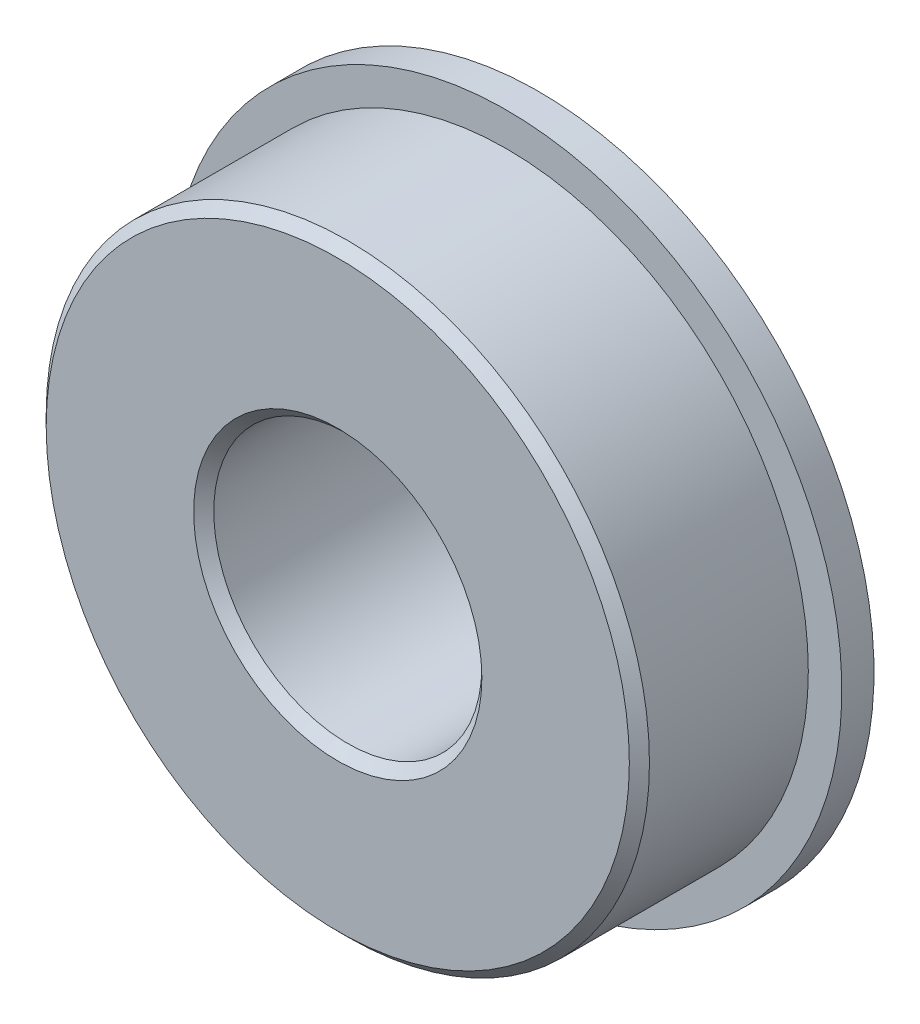
ISO-10303-21;
HEADER;
FILE_DESCRIPTION(('STEP AP214'),'2;1');
FILE_NAME('part.step','',(''),(''),'','','');
FILE_SCHEMA(('AUTOMOTIVE_DESIGN { 1 0 10303 214 1 1 1 1 }'));
ENDSEC;
DATA;
#1=APPLICATION_CONTEXT('core data for automotive mechanical design processes');
#2=APPLICATION_PROTOCOL_DEFINITION('international standard','automotive_design',2000,#1);
#3=PRODUCT_CONTEXT('',#1,'mechanical');
#4=PRODUCT('Part','Part','',(#3));
#5=PRODUCT_RELATED_PRODUCT_CATEGORY('part','',(#4));
#6=PRODUCT_DEFINITION_FORMATION('','',#4);
#7=PRODUCT_DEFINITION_CONTEXT('part definition',#1,'design');
#8=PRODUCT_DEFINITION('design','',#6,#7);
#9=PRODUCT_DEFINITION_SHAPE('','',#8);
#10=(LENGTH_UNIT() NAMED_UNIT(*) SI_UNIT(.MILLI.,.METRE.));
#11=(NAMED_UNIT(*) PLANE_ANGLE_UNIT() SI_UNIT($,.RADIAN.));
#12=(NAMED_UNIT(*) SI_UNIT($,.STERADIAN.) SOLID_ANGLE_UNIT());
#13=UNCERTAINTY_MEASURE_WITH_UNIT(LENGTH_MEASURE(1.E-05),#10,'distance_accuracy_value','');
#14=(GEOMETRIC_REPRESENTATION_CONTEXT(3) GLOBAL_UNCERTAINTY_ASSIGNED_CONTEXT((#13)) GLOBAL_UNIT_ASSIGNED_CONTEXT((#10,
#11,#12)) REPRESENTATION_CONTEXT('',''));
#15=CARTESIAN_POINT('',(0.,0.,0.));
#16=DIRECTION('',(0.,0.,1.));
#17=DIRECTION('',(1.,0.,0.));
#18=AXIS2_PLACEMENT_3D('',#15,#16,#17);
#19=CARTESIAN_POINT('',(0.,0.,4.7625));
#20=DIRECTION('',(0.,0.,1.));
#21=DIRECTION('',(1.,0.,0.));
#22=AXIS2_PLACEMENT_3D('',#19,#20,#21);
#23=CYLINDRICAL_SURFACE('',#22,8.7376);
#24=CARTESIAN_POINT('',(0.,0.,-5.88645));
#25=DIRECTION('',(0.,0.,1.));
#26=DIRECTION('',(1.,0.,0.));
#27=AXIS2_PLACEMENT_3D('',#24,#25,#26);
#28=CIRCLE('',#27,8.7376);
#29=CARTESIAN_POINT('',(8.7376,0.,-5.88645));
#30=VERTEX_POINT('',#29);
#31=EDGE_CURVE('E58',#30,#30,#28,.T.);
#32=ORIENTED_EDGE('',*,*,#31,.T.);
#33=EDGE_LOOP('',(#32));
#34=FACE_BOUND('',#33,.T.);
#35=CARTESIAN_POINT('',(0.,0.,-4.7625));
#36=DIRECTION('',(0.,0.,1.));
#37=DIRECTION('',(1.,0.,0.));
#38=AXIS2_PLACEMENT_3D('',#35,#36,#37);
#39=CIRCLE('',#38,8.7376);
#40=CARTESIAN_POINT('',(8.7376,0.,-4.7625));
#41=VERTEX_POINT('',#40);
#42=EDGE_CURVE('E10',#41,#41,#39,.T.);
#43=ORIENTED_EDGE('',*,*,#42,.F.);
#44=EDGE_LOOP('',(#43));
#45=FACE_BOUND('',#44,.T.);
#46=ADVANCED_FACE('F32',(#34,#45),#23,.T.);
#47=CARTESIAN_POINT('',(0.,6.82625,4.7625));
#48=DIRECTION('',(0.,0.,-1.));
#49=DIRECTION('',(-1.,0.,0.));
#50=AXIS2_PLACEMENT_3D('',#47,#48,#49);
#51=PLANE('',#50);
#52=CARTESIAN_POINT('',(0.,0.,4.7625));
#53=DIRECTION('',(0.,0.,1.));
#54=DIRECTION('',(1.,0.,0.));
#55=AXIS2_PLACEMENT_3D('',#52,#53,#54);
#56=CIRCLE('',#55,13.81125);
#57=CARTESIAN_POINT('',(13.81125,0.,4.7625));
#58=VERTEX_POINT('',#57);
#59=EDGE_CURVE('E64',#58,#58,#56,.T.);
#60=ORIENTED_EDGE('',*,*,#59,.T.);
#61=EDGE_LOOP('',(#60));
#62=FACE_BOUND('',#61,.T.);
#63=CARTESIAN_POINT('',(0.,0.,4.7625));
#64=DIRECTION('',(0.,0.,1.));
#65=DIRECTION('',(1.,0.,0.));
#66=AXIS2_PLACEMENT_3D('',#63,#64,#65);
#67=CIRCLE('',#66,6.82625);
#68=CARTESIAN_POINT('',(6.82625,0.,4.7625));
#69=VERTEX_POINT('',#68);
#70=EDGE_CURVE('E39',#69,#69,#67,.T.);
#71=ORIENTED_EDGE('',*,*,#70,.F.);
#72=EDGE_LOOP('',(#71));
#73=FACE_BOUND('',#72,.T.);
#74=ADVANCED_FACE('F34',(#62,#73),#51,.F.);
#75=CARTESIAN_POINT('',(0.,0.,4.7625));
#76=DIRECTION('',(0.,0.,1.));
#77=DIRECTION('',(1.,0.,0.));
#78=AXIS2_PLACEMENT_3D('',#75,#76,#77);
#79=CONICAL_SURFACE('',#78,6.82625,0.785398163397449);
#80=CARTESIAN_POINT('',(0.,0.,4.28625));
#81=DIRECTION('',(0.,0.,1.));
#82=DIRECTION('',(1.,0.,0.));
#83=AXIS2_PLACEMENT_3D('',#80,#81,#82);
#84=CIRCLE('',#83,6.35);
#85=CARTESIAN_POINT('',(6.35,0.,4.28625));
#86=VERTEX_POINT('',#85);
#87=EDGE_CURVE('E43',#86,#86,#84,.T.);
#88=ORIENTED_EDGE('',*,*,#87,.F.);
#89=EDGE_LOOP('',(#88));
#90=FACE_BOUND('',#89,.T.);
#91=ORIENTED_EDGE('',*,*,#70,.T.);
#92=EDGE_LOOP('',(#91));
#93=FACE_BOUND('',#92,.T.);
#94=ADVANCED_FACE('F109',(#90,#93),#79,.F.);
#95=CARTESIAN_POINT('',(0.,0.,4.7625));
#96=DIRECTION('',(0.,0.,1.));
#97=DIRECTION('',(1.,0.,0.));
#98=AXIS2_PLACEMENT_3D('',#95,#96,#97);
#99=CYLINDRICAL_SURFACE('',#98,6.35);
#100=CARTESIAN_POINT('',(0.,0.,-5.88645));
#101=DIRECTION('',(0.,0.,1.));
#102=DIRECTION('',(1.,0.,0.));
#103=AXIS2_PLACEMENT_3D('',#100,#101,#102);
#104=CIRCLE('',#103,6.35);
#105=CARTESIAN_POINT('',(6.35,0.,-5.88645));
#106=VERTEX_POINT('',#105);
#107=EDGE_CURVE('E47',#106,#106,#104,.T.);
#108=ORIENTED_EDGE('',*,*,#107,.F.);
#109=EDGE_LOOP('',(#108));
#110=FACE_BOUND('',#109,.T.);
#111=ORIENTED_EDGE('',*,*,#87,.T.);
#112=EDGE_LOOP('',(#111));
#113=FACE_BOUND('',#112,.T.);
#114=ADVANCED_FACE('F123',(#110,#113),#99,.F.);
#115=CARTESIAN_POINT('',(0.,0.,-5.88645));
#116=DIRECTION('',(0.,0.,-1.));
#117=DIRECTION('',(-1.,0.,0.));
#118=AXIS2_PLACEMENT_3D('',#115,#116,#117);
#119=CONICAL_SURFACE('',#118,6.35,0.785398163397448);
#120=CARTESIAN_POINT('',(0.,0.,-6.3627));
#121=DIRECTION('',(0.,0.,1.));
#122=DIRECTION('',(1.,0.,0.));
#123=AXIS2_PLACEMENT_3D('',#120,#121,#122);
#124=CIRCLE('',#123,6.82625);
#125=CARTESIAN_POINT('',(6.82625,0.,-6.3627));
#126=VERTEX_POINT('',#125);
#127=EDGE_CURVE('E52',#126,#126,#124,.T.);
#128=ORIENTED_EDGE('',*,*,#127,.F.);
#129=EDGE_LOOP('',(#128));
#130=FACE_BOUND('',#129,.T.);
#131=ORIENTED_EDGE('',*,*,#107,.T.);
#132=EDGE_LOOP('',(#131));
#133=FACE_BOUND('',#132,.T.);
#134=ADVANCED_FACE('F119',(#130,#133),#119,.F.);
#135=CARTESIAN_POINT('',(0.,8.26135,-6.3627));
#136=DIRECTION('',(0.,0.,1.));
#137=DIRECTION('',(1.,0.,0.));
#138=AXIS2_PLACEMENT_3D('',#135,#136,#137);
#139=PLANE('',#138);
#140=CARTESIAN_POINT('',(0.,0.,-6.3627));
#141=DIRECTION('',(0.,0.,1.));
#142=DIRECTION('',(1.,0.,0.));
#143=AXIS2_PLACEMENT_3D('',#140,#141,#142);
#144=CIRCLE('',#143,8.26135);
#145=CARTESIAN_POINT('',(8.26135,0.,-6.3627));
#146=VERTEX_POINT('',#145);
#147=EDGE_CURVE('E55',#146,#146,#144,.T.);
#148=ORIENTED_EDGE('',*,*,#147,.F.);
#149=EDGE_LOOP('',(#148));
#150=FACE_BOUND('',#149,.T.);
#151=ORIENTED_EDGE('',*,*,#127,.T.);
#152=EDGE_LOOP('',(#151));
#153=FACE_BOUND('',#152,.T.);
#154=ADVANCED_FACE('F115',(#150,#153),#139,.F.);
#155=CARTESIAN_POINT('',(0.,0.,-6.3627));
#156=DIRECTION('',(0.,0.,1.));
#157=DIRECTION('',(1.,0.,0.));
#158=AXIS2_PLACEMENT_3D('',#155,#156,#157);
#159=CONICAL_SURFACE('',#158,8.26135,0.785398163397447);
#160=ORIENTED_EDGE('',*,*,#31,.F.);
#161=EDGE_LOOP('',(#160));
#162=FACE_BOUND('',#161,.T.);
#163=ORIENTED_EDGE('',*,*,#147,.T.);
#164=EDGE_LOOP('',(#163));
#165=FACE_BOUND('',#164,.T.);
#166=ADVANCED_FACE('F100',(#162,#165),#159,.T.);
#167=CARTESIAN_POINT('',(0.,13.81125,-4.7625));
#168=DIRECTION('',(0.,0.,1.));
#169=DIRECTION('',(1.,0.,0.));
#170=AXIS2_PLACEMENT_3D('',#167,#168,#169);
#171=PLANE('',#170);
#172=ORIENTED_EDGE('',*,*,#42,.T.);
#173=EDGE_LOOP('',(#172));
#174=FACE_BOUND('',#173,.T.);
#175=CARTESIAN_POINT('',(0.,0.,-4.7625));
#176=DIRECTION('',(0.,0.,-1.));
#177=DIRECTION('',(-1.,0.,0.));
#178=AXIS2_PLACEMENT_3D('',#175,#176,#177);
#179=CIRCLE('',#178,15.875);
#180=CARTESIAN_POINT('',(-15.875,0.,-4.7625));
#181=VERTEX_POINT('',#180);
#182=EDGE_CURVE('E70',#181,#181,#179,.T.);
#183=ORIENTED_EDGE('',*,*,#182,.T.);
#184=EDGE_LOOP('',(#183));
#185=FACE_BOUND('',#184,.T.);
#186=ADVANCED_FACE('F94',(#174,#185),#171,.F.);
#187=CARTESIAN_POINT('',(0.,0.,4.28625));
#188=DIRECTION('',(0.,0.,-1.));
#189=DIRECTION('',(-1.,0.,0.));
#190=AXIS2_PLACEMENT_3D('',#187,#188,#189);
#191=CONICAL_SURFACE('',#190,14.2875,0.785398163397445);
#192=ORIENTED_EDGE('',*,*,#59,.F.);
#193=EDGE_LOOP('',(#192));
#194=FACE_BOUND('',#193,.T.);
#195=CARTESIAN_POINT('',(0.,0.,4.28625));
#196=DIRECTION('',(0.,0.,1.));
#197=DIRECTION('',(1.,0.,0.));
#198=AXIS2_PLACEMENT_3D('',#195,#196,#197);
#199=CIRCLE('',#198,14.2875);
#200=CARTESIAN_POINT('',(14.2875,0.,4.28625));
#201=VERTEX_POINT('',#200);
#202=EDGE_CURVE('E61',#201,#201,#199,.T.);
#203=ORIENTED_EDGE('',*,*,#202,.T.);
#204=EDGE_LOOP('',(#203));
#205=FACE_BOUND('',#204,.T.);
#206=ADVANCED_FACE('F89',(#194,#205),#191,.T.);
#207=CARTESIAN_POINT('',(0.,0.,4.7625));
#208=DIRECTION('',(0.,0.,1.));
#209=DIRECTION('',(1.,0.,0.));
#210=AXIS2_PLACEMENT_3D('',#207,#208,#209);
#211=CYLINDRICAL_SURFACE('',#210,14.2875);
#212=CARTESIAN_POINT('',(0.,0.,-3.2385));
#213=DIRECTION('',(0.,0.,1.));
#214=DIRECTION('',(1.,0.,0.));
#215=AXIS2_PLACEMENT_3D('',#212,#213,#214);
#216=CIRCLE('',#215,14.2875);
#217=CARTESIAN_POINT('',(14.2875,0.,-3.2385));
#218=VERTEX_POINT('',#217);
#219=EDGE_CURVE('E67',#218,#218,#216,.T.);
#220=ORIENTED_EDGE('',*,*,#219,.T.);
#221=EDGE_LOOP('',(#220));
#222=FACE_BOUND('',#221,.T.);
#223=ORIENTED_EDGE('',*,*,#202,.F.);
#224=EDGE_LOOP('',(#223));
#225=FACE_BOUND('',#224,.T.);
#226=ADVANCED_FACE('F83',(#222,#225),#211,.T.);
#227=CARTESIAN_POINT('',(0.,10.7188,-3.2385));
#228=DIRECTION('',(0.,0.,1.));
#229=DIRECTION('',(1.,0.,0.));
#230=AXIS2_PLACEMENT_3D('',#227,#228,#229);
#231=PLANE('',#230);
#232=CARTESIAN_POINT('',(0.,0.,-3.2385));
#233=DIRECTION('',(0.,0.,-1.));
#234=DIRECTION('',(-1.,0.,0.));
#235=AXIS2_PLACEMENT_3D('',#232,#233,#234);
#236=CIRCLE('',#235,15.875);
#237=CARTESIAN_POINT('',(-15.875,0.,-3.2385));
#238=VERTEX_POINT('',#237);
#239=EDGE_CURVE('E73',#238,#238,#236,.T.);
#240=ORIENTED_EDGE('',*,*,#239,.F.);
#241=EDGE_LOOP('',(#240));
#242=FACE_BOUND('',#241,.T.);
#243=ORIENTED_EDGE('',*,*,#219,.F.);
#244=EDGE_LOOP('',(#243));
#245=FACE_BOUND('',#244,.T.);
#246=ADVANCED_FACE('F80',(#242,#245),#231,.T.);
#247=CARTESIAN_POINT('',(0.,0.,-4.7625));
#248=DIRECTION('',(0.,0.,-1.));
#249=DIRECTION('',(-1.,0.,0.));
#250=AXIS2_PLACEMENT_3D('',#247,#248,#249);
#251=CYLINDRICAL_SURFACE('',#250,15.875);
#252=ORIENTED_EDGE('',*,*,#239,.T.);
#253=EDGE_LOOP('',(#252));
#254=FACE_BOUND('',#253,.T.);
#255=ORIENTED_EDGE('',*,*,#182,.F.);
#256=EDGE_LOOP('',(#255));
#257=FACE_BOUND('',#256,.T.);
#258=ADVANCED_FACE('F77',(#254,#257),#251,.T.);
#259=CLOSED_SHELL('',(#46,#74,#94,#114,#134,#154,#166,#186,#206,#226,#246,#258));
#260=MANIFOLD_SOLID_BREP('B2',#259);
#261=ADVANCED_BREP_SHAPE_REPRESENTATION('',(#18,#260),#14);
#262=SHAPE_DEFINITION_REPRESENTATION(#9,#261);
ENDSEC;
END-ISO-10303-21;
